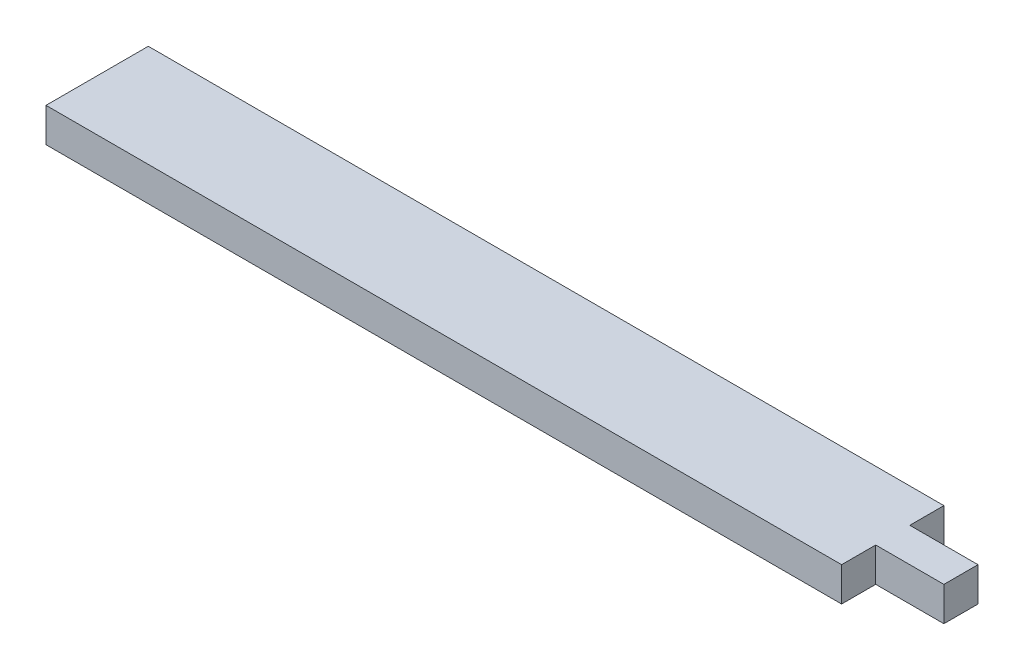
ISO-10303-21;
HEADER;
FILE_DESCRIPTION(('STEP AP214'),'2;1');
FILE_NAME('part.step','',(''),(''),'','','');
FILE_SCHEMA(('AUTOMOTIVE_DESIGN { 1 0 10303 214 1 1 1 1 }'));
ENDSEC;
DATA;
#1=APPLICATION_CONTEXT('core data for automotive mechanical design processes');
#2=APPLICATION_PROTOCOL_DEFINITION('international standard','automotive_design',2000,#1);
#3=PRODUCT_CONTEXT('',#1,'mechanical');
#4=PRODUCT('Part','Part','',(#3));
#5=PRODUCT_RELATED_PRODUCT_CATEGORY('part','',(#4));
#6=PRODUCT_DEFINITION_FORMATION('','',#4);
#7=PRODUCT_DEFINITION_CONTEXT('part definition',#1,'design');
#8=PRODUCT_DEFINITION('design','',#6,#7);
#9=PRODUCT_DEFINITION_SHAPE('','',#8);
#10=(LENGTH_UNIT() NAMED_UNIT(*) SI_UNIT(.MILLI.,.METRE.));
#11=(NAMED_UNIT(*) PLANE_ANGLE_UNIT() SI_UNIT($,.RADIAN.));
#12=(NAMED_UNIT(*) SI_UNIT($,.STERADIAN.) SOLID_ANGLE_UNIT());
#13=UNCERTAINTY_MEASURE_WITH_UNIT(LENGTH_MEASURE(1.E-05),#10,'distance_accuracy_value','');
#14=(GEOMETRIC_REPRESENTATION_CONTEXT(3) GLOBAL_UNCERTAINTY_ASSIGNED_CONTEXT((#13)) GLOBAL_UNIT_ASSIGNED_CONTEXT((#10,
#11,#12)) REPRESENTATION_CONTEXT('',''));
#15=CARTESIAN_POINT('',(0.,0.,0.));
#16=DIRECTION('',(0.,0.,1.));
#17=DIRECTION('',(1.,0.,0.));
#18=AXIS2_PLACEMENT_3D('',#15,#16,#17);
#19=CARTESIAN_POINT('',(40.994,0.003,-1.497));
#20=DIRECTION('',(-1.,0.,0.));
#21=DIRECTION('',(0.,0.,1.));
#22=AXIS2_PLACEMENT_3D('',#19,#20,#21);
#23=PLANE('',#22);
#24=DIRECTION('',(0.,0.,-1.));
#25=VECTOR('',#24,1.);
#26=CARTESIAN_POINT('',(40.994,0.,-1.497));
#27=LINE('',#26,#25);
#28=CARTESIAN_POINT('',(40.994,0.,-1.494));
#29=VERTEX_POINT('',#28);
#30=CARTESIAN_POINT('',(40.994,0.,-1.497));
#31=VERTEX_POINT('',#30);
#32=EDGE_CURVE('E129',#29,#31,#27,.T.);
#33=ORIENTED_EDGE('',*,*,#32,.T.);
#34=DIRECTION('',(0.,-1.,0.));
#35=VECTOR('',#34,1.);
#36=CARTESIAN_POINT('',(40.994,0.003,-1.497));
#37=LINE('',#36,#35);
#38=CARTESIAN_POINT('',(40.994,0.003,-1.497));
#39=VERTEX_POINT('',#38);
#40=EDGE_CURVE('E11',#39,#31,#37,.T.);
#41=ORIENTED_EDGE('',*,*,#40,.F.);
#42=DIRECTION('',(0.,0.,-1.));
#43=VECTOR('',#42,1.);
#44=CARTESIAN_POINT('',(40.994,0.003,-1.497));
#45=LINE('',#44,#43);
#46=CARTESIAN_POINT('',(40.994,0.003,-1.494));
#47=VERTEX_POINT('',#46);
#48=EDGE_CURVE('E143',#47,#39,#45,.T.);
#49=ORIENTED_EDGE('',*,*,#48,.F.);
#50=DIRECTION('',(0.,-1.,0.));
#51=VECTOR('',#50,1.);
#52=CARTESIAN_POINT('',(40.994,0.003,-1.494));
#53=LINE('',#52,#51);
#54=EDGE_CURVE('E125',#47,#29,#53,.T.);
#55=ORIENTED_EDGE('',*,*,#54,.T.);
#56=EDGE_LOOP('',(#33,#41,#49,#55));
#57=FACE_BOUND('',#56,.T.);
#58=ADVANCED_FACE('F33',(#57),#23,.F.);
#59=CARTESIAN_POINT('',(40.994,0.003,-1.497));
#60=DIRECTION('',(0.,0.,-1.));
#61=DIRECTION('',(-1.,0.,0.));
#62=AXIS2_PLACEMENT_3D('',#59,#60,#61);
#63=PLANE('',#62);
#64=DIRECTION('',(1.,0.,0.));
#65=VECTOR('',#64,1.);
#66=CARTESIAN_POINT('',(40.994,0.,-1.497));
#67=LINE('',#66,#65);
#68=CARTESIAN_POINT('',(41.,0.,-1.497));
#69=VERTEX_POINT('',#68);
#70=EDGE_CURVE('E132',#31,#69,#67,.T.);
#71=ORIENTED_EDGE('',*,*,#70,.T.);
#72=DIRECTION('',(0.,-1.,0.));
#73=VECTOR('',#72,1.);
#74=CARTESIAN_POINT('',(41.,0.003,-1.497));
#75=LINE('',#74,#73);
#76=CARTESIAN_POINT('',(41.,0.003,-1.497));
#77=VERTEX_POINT('',#76);
#78=EDGE_CURVE('E41',#77,#69,#75,.T.);
#79=ORIENTED_EDGE('',*,*,#78,.F.);
#80=DIRECTION('',(1.,0.,0.));
#81=VECTOR('',#80,1.);
#82=CARTESIAN_POINT('',(40.994,0.003,-1.497));
#83=LINE('',#82,#81);
#84=EDGE_CURVE('E92',#39,#77,#83,.T.);
#85=ORIENTED_EDGE('',*,*,#84,.F.);
#86=ORIENTED_EDGE('',*,*,#40,.T.);
#87=EDGE_LOOP('',(#71,#79,#85,#86));
#88=FACE_BOUND('',#87,.T.);
#89=ADVANCED_FACE('F178',(#88),#63,.F.);
#90=CARTESIAN_POINT('',(41.,0.003,-1.497));
#91=DIRECTION('',(-1.,0.,0.));
#92=DIRECTION('',(0.,0.,1.));
#93=AXIS2_PLACEMENT_3D('',#90,#91,#92);
#94=PLANE('',#93);
#95=DIRECTION('',(0.,0.,-1.));
#96=VECTOR('',#95,1.);
#97=CARTESIAN_POINT('',(41.,0.,-1.497));
#98=LINE('',#97,#96);
#99=CARTESIAN_POINT('',(41.,0.,-1.5));
#100=VERTEX_POINT('',#99);
#101=EDGE_CURVE('E134',#69,#100,#98,.T.);
#102=ORIENTED_EDGE('',*,*,#101,.T.);
#103=DIRECTION('',(0.,-1.,0.));
#104=VECTOR('',#103,1.);
#105=CARTESIAN_POINT('',(41.,0.003,-1.5));
#106=LINE('',#105,#104);
#107=CARTESIAN_POINT('',(41.,0.003,-1.5));
#108=VERTEX_POINT('',#107);
#109=EDGE_CURVE('E150',#108,#100,#106,.T.);
#110=ORIENTED_EDGE('',*,*,#109,.F.);
#111=DIRECTION('',(0.,0.,-1.));
#112=VECTOR('',#111,1.);
#113=CARTESIAN_POINT('',(41.,0.003,-1.497));
#114=LINE('',#113,#112);
#115=EDGE_CURVE('E158',#77,#108,#114,.T.);
#116=ORIENTED_EDGE('',*,*,#115,.F.);
#117=ORIENTED_EDGE('',*,*,#78,.T.);
#118=EDGE_LOOP('',(#102,#110,#116,#117));
#119=FACE_BOUND('',#118,.T.);
#120=ADVANCED_FACE('F156',(#119),#94,.F.);
#121=CARTESIAN_POINT('',(41.,0.003,-1.5));
#122=DIRECTION('',(0.,0.,1.));
#123=DIRECTION('',(1.,0.,0.));
#124=AXIS2_PLACEMENT_3D('',#121,#122,#123);
#125=PLANE('',#124);
#126=DIRECTION('',(-1.,0.,0.));
#127=VECTOR('',#126,1.);
#128=CARTESIAN_POINT('',(41.,0.,-1.5));
#129=LINE('',#128,#127);
#130=CARTESIAN_POINT('',(40.994,0.,-1.5));
#131=VERTEX_POINT('',#130);
#132=EDGE_CURVE('E136',#100,#131,#129,.T.);
#133=ORIENTED_EDGE('',*,*,#132,.T.);
#134=DIRECTION('',(0.,-1.,0.));
#135=VECTOR('',#134,1.);
#136=CARTESIAN_POINT('',(40.994,0.003,-1.5));
#137=LINE('',#136,#135);
#138=CARTESIAN_POINT('',(40.994,0.003,-1.5));
#139=VERTEX_POINT('',#138);
#140=EDGE_CURVE('E147',#139,#131,#137,.T.);
#141=ORIENTED_EDGE('',*,*,#140,.F.);
#142=DIRECTION('',(-1.,0.,0.));
#143=VECTOR('',#142,1.);
#144=CARTESIAN_POINT('',(41.,0.003,-1.5));
#145=LINE('',#144,#143);
#146=EDGE_CURVE('E170',#108,#139,#145,.T.);
#147=ORIENTED_EDGE('',*,*,#146,.F.);
#148=ORIENTED_EDGE('',*,*,#109,.T.);
#149=EDGE_LOOP('',(#133,#141,#147,#148));
#150=FACE_BOUND('',#149,.T.);
#151=ADVANCED_FACE('F166',(#150),#125,.F.);
#152=CARTESIAN_POINT('',(40.994,0.003,-1.503));
#153=DIRECTION('',(-1.,0.,0.));
#154=DIRECTION('',(0.,0.,1.));
#155=AXIS2_PLACEMENT_3D('',#152,#153,#154);
#156=PLANE('',#155);
#157=DIRECTION('',(0.,0.,-1.));
#158=VECTOR('',#157,1.);
#159=CARTESIAN_POINT('',(40.994,0.,-1.503));
#160=LINE('',#159,#158);
#161=CARTESIAN_POINT('',(40.994,0.,-1.503));
#162=VERTEX_POINT('',#161);
#163=EDGE_CURVE('E138',#131,#162,#160,.T.);
#164=ORIENTED_EDGE('',*,*,#163,.T.);
#165=DIRECTION('',(0.,-1.,0.));
#166=VECTOR('',#165,1.);
#167=CARTESIAN_POINT('',(40.994,0.003,-1.503));
#168=LINE('',#167,#166);
#169=CARTESIAN_POINT('',(40.994,0.003,-1.503));
#170=VERTEX_POINT('',#169);
#171=EDGE_CURVE('E120',#170,#162,#168,.T.);
#172=ORIENTED_EDGE('',*,*,#171,.F.);
#173=DIRECTION('',(0.,0.,-1.));
#174=VECTOR('',#173,1.);
#175=CARTESIAN_POINT('',(40.994,0.003,-1.503));
#176=LINE('',#175,#174);
#177=EDGE_CURVE('E111',#139,#170,#176,.T.);
#178=ORIENTED_EDGE('',*,*,#177,.F.);
#179=ORIENTED_EDGE('',*,*,#140,.T.);
#180=EDGE_LOOP('',(#164,#172,#178,#179));
#181=FACE_BOUND('',#180,.T.);
#182=ADVANCED_FACE('F169',(#181),#156,.F.);
#183=CARTESIAN_POINT('',(40.924,0.003,-1.503));
#184=DIRECTION('',(0.,0.,1.));
#185=DIRECTION('',(1.,0.,0.));
#186=AXIS2_PLACEMENT_3D('',#183,#184,#185);
#187=PLANE('',#186);
#188=DIRECTION('',(-1.,0.,0.));
#189=VECTOR('',#188,1.);
#190=CARTESIAN_POINT('',(40.924,0.,-1.503));
#191=LINE('',#190,#189);
#192=CARTESIAN_POINT('',(40.924,0.,-1.503));
#193=VERTEX_POINT('',#192);
#194=EDGE_CURVE('E119',#162,#193,#191,.T.);
#195=ORIENTED_EDGE('',*,*,#194,.T.);
#196=DIRECTION('',(0.,-1.,0.));
#197=VECTOR('',#196,1.);
#198=CARTESIAN_POINT('',(40.924,0.003,-1.503));
#199=LINE('',#198,#197);
#200=CARTESIAN_POINT('',(40.924,0.003,-1.503));
#201=VERTEX_POINT('',#200);
#202=EDGE_CURVE('E116',#201,#193,#199,.T.);
#203=ORIENTED_EDGE('',*,*,#202,.F.);
#204=DIRECTION('',(-1.,0.,0.));
#205=VECTOR('',#204,1.);
#206=CARTESIAN_POINT('',(40.924,0.003,-1.503));
#207=LINE('',#206,#205);
#208=EDGE_CURVE('E105',#170,#201,#207,.T.);
#209=ORIENTED_EDGE('',*,*,#208,.F.);
#210=ORIENTED_EDGE('',*,*,#171,.T.);
#211=EDGE_LOOP('',(#195,#203,#209,#210));
#212=FACE_BOUND('',#211,.T.);
#213=ADVANCED_FACE('F117',(#212),#187,.F.);
#214=CARTESIAN_POINT('',(40.924,0.003,-1.503));
#215=DIRECTION('',(1.,0.,0.));
#216=DIRECTION('',(0.,0.,-1.));
#217=AXIS2_PLACEMENT_3D('',#214,#215,#216);
#218=PLANE('',#217);
#219=DIRECTION('',(0.,0.,1.));
#220=VECTOR('',#219,1.);
#221=CARTESIAN_POINT('',(40.924,0.,-1.503));
#222=LINE('',#221,#220);
#223=CARTESIAN_POINT('',(40.924,0.,-1.494));
#224=VERTEX_POINT('',#223);
#225=EDGE_CURVE('E78',#193,#224,#222,.T.);
#226=ORIENTED_EDGE('',*,*,#225,.T.);
#227=DIRECTION('',(0.,-1.,0.));
#228=VECTOR('',#227,1.);
#229=CARTESIAN_POINT('',(40.924,0.003,-1.494));
#230=LINE('',#229,#228);
#231=CARTESIAN_POINT('',(40.924,0.003,-1.494));
#232=VERTEX_POINT('',#231);
#233=EDGE_CURVE('E121',#232,#224,#230,.T.);
#234=ORIENTED_EDGE('',*,*,#233,.F.);
#235=DIRECTION('',(0.,0.,1.));
#236=VECTOR('',#235,1.);
#237=CARTESIAN_POINT('',(40.924,0.003,-1.503));
#238=LINE('',#237,#236);
#239=EDGE_CURVE('E109',#201,#232,#238,.T.);
#240=ORIENTED_EDGE('',*,*,#239,.F.);
#241=ORIENTED_EDGE('',*,*,#202,.T.);
#242=EDGE_LOOP('',(#226,#234,#240,#241));
#243=FACE_BOUND('',#242,.T.);
#244=ADVANCED_FACE('F123',(#243),#218,.F.);
#245=CARTESIAN_POINT('',(40.924,0.003,-1.494));
#246=DIRECTION('',(0.,0.,-1.));
#247=DIRECTION('',(-1.,0.,0.));
#248=AXIS2_PLACEMENT_3D('',#245,#246,#247);
#249=PLANE('',#248);
#250=DIRECTION('',(1.,0.,0.));
#251=VECTOR('',#250,1.);
#252=CARTESIAN_POINT('',(40.924,0.,-1.494));
#253=LINE('',#252,#251);
#254=EDGE_CURVE('E84',#224,#29,#253,.T.);
#255=ORIENTED_EDGE('',*,*,#254,.T.);
#256=ORIENTED_EDGE('',*,*,#54,.F.);
#257=DIRECTION('',(1.,0.,0.));
#258=VECTOR('',#257,1.);
#259=CARTESIAN_POINT('',(40.924,0.003,-1.494));
#260=LINE('',#259,#258);
#261=EDGE_CURVE('E49',#232,#47,#260,.T.);
#262=ORIENTED_EDGE('',*,*,#261,.F.);
#263=ORIENTED_EDGE('',*,*,#233,.T.);
#264=EDGE_LOOP('',(#255,#256,#262,#263));
#265=FACE_BOUND('',#264,.T.);
#266=ADVANCED_FACE('F194',(#265),#249,.F.);
#267=CARTESIAN_POINT('',(40.959,0.003,-1.4985));
#268=DIRECTION('',(0.,1.,0.));
#269=DIRECTION('',(0.,0.,1.));
#270=AXIS2_PLACEMENT_3D('',#267,#268,#269);
#271=PLANE('',#270);
#272=ORIENTED_EDGE('',*,*,#48,.T.);
#273=ORIENTED_EDGE('',*,*,#84,.T.);
#274=ORIENTED_EDGE('',*,*,#115,.T.);
#275=ORIENTED_EDGE('',*,*,#146,.T.);
#276=ORIENTED_EDGE('',*,*,#177,.T.);
#277=ORIENTED_EDGE('',*,*,#208,.T.);
#278=ORIENTED_EDGE('',*,*,#239,.T.);
#279=ORIENTED_EDGE('',*,*,#261,.T.);
#280=EDGE_LOOP('',(#272,#273,#274,#275,#276,#277,#278,#279));
#281=FACE_BOUND('',#280,.T.);
#282=ADVANCED_FACE('F107',(#281),#271,.T.);
#283=CARTESIAN_POINT('',(40.959,0.,-1.4985));
#284=DIRECTION('',(0.,1.,0.));
#285=DIRECTION('',(0.,0.,1.));
#286=AXIS2_PLACEMENT_3D('',#283,#284,#285);
#287=PLANE('',#286);
#288=ORIENTED_EDGE('',*,*,#32,.F.);
#289=ORIENTED_EDGE('',*,*,#254,.F.);
#290=ORIENTED_EDGE('',*,*,#225,.F.);
#291=ORIENTED_EDGE('',*,*,#194,.F.);
#292=ORIENTED_EDGE('',*,*,#163,.F.);
#293=ORIENTED_EDGE('',*,*,#132,.F.);
#294=ORIENTED_EDGE('',*,*,#101,.F.);
#295=ORIENTED_EDGE('',*,*,#70,.F.);
#296=EDGE_LOOP('',(#288,#289,#290,#291,#292,#293,#294,#295));
#297=FACE_BOUND('',#296,.T.);
#298=ADVANCED_FACE('F162',(#297),#287,.F.);
#299=CLOSED_SHELL('',(#58,#89,#120,#151,#182,#213,#244,#266,#282,#298));
#300=MANIFOLD_SOLID_BREP('B2',#299);
#301=ADVANCED_BREP_SHAPE_REPRESENTATION('',(#18,#300),#14);
#302=SHAPE_DEFINITION_REPRESENTATION(#9,#301);
ENDSEC;
END-ISO-10303-21;
